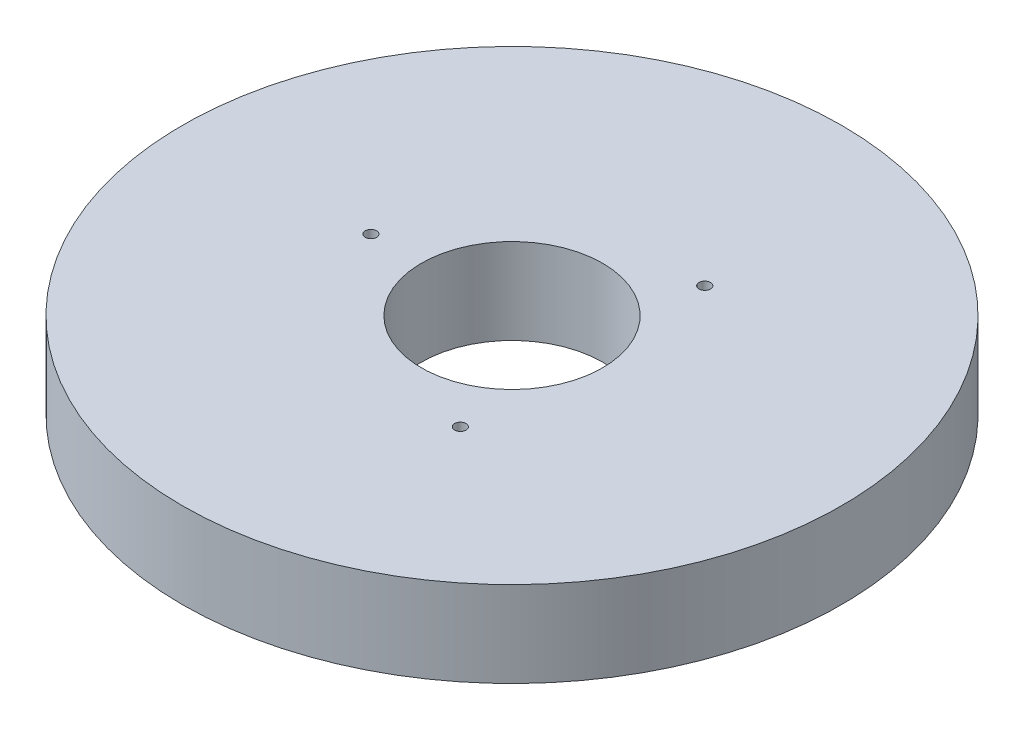
ISO-10303-21;
HEADER;
FILE_DESCRIPTION(('STEP AP214'),'2;1');
FILE_NAME('part.step','',(''),(''),'','','');
FILE_SCHEMA(('AUTOMOTIVE_DESIGN { 1 0 10303 214 1 1 1 1 }'));
ENDSEC;
DATA;
#1=APPLICATION_CONTEXT('core data for automotive mechanical design processes');
#2=APPLICATION_PROTOCOL_DEFINITION('international standard','automotive_design',2000,#1);
#3=PRODUCT_CONTEXT('',#1,'mechanical');
#4=PRODUCT('Part','Part','',(#3));
#5=PRODUCT_RELATED_PRODUCT_CATEGORY('part','',(#4));
#6=PRODUCT_DEFINITION_FORMATION('','',#4);
#7=PRODUCT_DEFINITION_CONTEXT('part definition',#1,'design');
#8=PRODUCT_DEFINITION('design','',#6,#7);
#9=PRODUCT_DEFINITION_SHAPE('','',#8);
#10=(LENGTH_UNIT() NAMED_UNIT(*) SI_UNIT(.MILLI.,.METRE.));
#11=(NAMED_UNIT(*) PLANE_ANGLE_UNIT() SI_UNIT($,.RADIAN.));
#12=(NAMED_UNIT(*) SI_UNIT($,.STERADIAN.) SOLID_ANGLE_UNIT());
#13=UNCERTAINTY_MEASURE_WITH_UNIT(LENGTH_MEASURE(1.E-05),#10,'distance_accuracy_value','');
#14=(GEOMETRIC_REPRESENTATION_CONTEXT(3) GLOBAL_UNCERTAINTY_ASSIGNED_CONTEXT((#13)) GLOBAL_UNIT_ASSIGNED_CONTEXT((#10,
#11,#12)) REPRESENTATION_CONTEXT('',''));
#15=CARTESIAN_POINT('',(0.,0.,0.));
#16=DIRECTION('',(0.,0.,1.));
#17=DIRECTION('',(1.,0.,0.));
#18=AXIS2_PLACEMENT_3D('',#15,#16,#17);
#19=CARTESIAN_POINT('',(0.,26.,0.));
#20=DIRECTION('',(0.,-1.,0.));
#21=DIRECTION('',(0.,0.,-1.));
#22=AXIS2_PLACEMENT_3D('',#19,#20,#21);
#23=CYLINDRICAL_SURFACE('',#22,100.);
#24=CARTESIAN_POINT('',(0.,26.,0.));
#25=DIRECTION('',(0.,1.,0.));
#26=DIRECTION('',(0.,0.,1.));
#27=AXIS2_PLACEMENT_3D('',#24,#25,#26);
#28=CIRCLE('',#27,100.);
#29=CARTESIAN_POINT('',(0.,26.,-100.));
#30=VERTEX_POINT('',#29);
#31=EDGE_CURVE('E10',#30,#30,#28,.T.);
#32=CARTESIAN_POINT('',(0.,0.,0.));
#33=DIRECTION('',(0.,1.,0.));
#34=DIRECTION('',(0.,0.,1.));
#35=AXIS2_PLACEMENT_3D('',#32,#33,#34);
#36=CIRCLE('',#35,100.);
#37=CARTESIAN_POINT('',(0.,0.,-100.));
#38=VERTEX_POINT('',#37);
#39=EDGE_CURVE('E37',#38,#38,#36,.T.);
#40=CARTESIAN_POINT('',(0.,26.,-100.));
#41=CARTESIAN_POINT('',(0.,25.7291666666667,-100.));
#42=CARTESIAN_POINT('',(0.,25.4583333333333,-100.));
#43=CARTESIAN_POINT('',(0.,24.9166666666667,-100.));
#44=CARTESIAN_POINT('',(0.,24.6458333333333,-100.));
#45=CARTESIAN_POINT('',(0.,24.1041666666667,-100.));
#46=CARTESIAN_POINT('',(0.,23.8333333333333,-100.));
#47=CARTESIAN_POINT('',(0.,23.2916666666667,-100.));
#48=CARTESIAN_POINT('',(0.,23.0208333333333,-100.));
#49=CARTESIAN_POINT('',(0.,22.4791666666667,-100.));
#50=CARTESIAN_POINT('',(0.,22.2083333333333,-100.));
#51=CARTESIAN_POINT('',(0.,21.6666666666667,-100.));
#52=CARTESIAN_POINT('',(0.,21.3958333333333,-100.));
#53=CARTESIAN_POINT('',(0.,20.8541666666667,-100.));
#54=CARTESIAN_POINT('',(0.,20.5833333333333,-100.));
#55=CARTESIAN_POINT('',(0.,20.0416666666667,-100.));
#56=CARTESIAN_POINT('',(0.,19.7708333333333,-100.));
#57=CARTESIAN_POINT('',(0.,19.2291666666667,-100.));
#58=CARTESIAN_POINT('',(0.,18.9583333333333,-100.));
#59=CARTESIAN_POINT('',(0.,18.4166666666667,-100.));
#60=CARTESIAN_POINT('',(0.,18.1458333333333,-100.));
#61=CARTESIAN_POINT('',(0.,17.6041666666667,-100.));
#62=CARTESIAN_POINT('',(0.,17.3333333333333,-100.));
#63=CARTESIAN_POINT('',(0.,16.7916666666667,-100.));
#64=CARTESIAN_POINT('',(0.,16.5208333333333,-100.));
#65=CARTESIAN_POINT('',(0.,15.9791666666667,-100.));
#66=CARTESIAN_POINT('',(0.,15.7083333333333,-100.));
#67=CARTESIAN_POINT('',(0.,15.1666666666667,-100.));
#68=CARTESIAN_POINT('',(0.,14.8958333333333,-100.));
#69=CARTESIAN_POINT('',(0.,14.3541666666667,-100.));
#70=CARTESIAN_POINT('',(0.,14.0833333333333,-100.));
#71=CARTESIAN_POINT('',(0.,13.5416666666667,-100.));
#72=CARTESIAN_POINT('',(0.,13.2708333333333,-100.));
#73=CARTESIAN_POINT('',(0.,12.7291666666667,-100.));
#74=CARTESIAN_POINT('',(0.,12.4583333333333,-100.));
#75=CARTESIAN_POINT('',(0.,11.9166666666667,-100.));
#76=CARTESIAN_POINT('',(0.,11.6458333333333,-100.));
#77=CARTESIAN_POINT('',(0.,11.1041666666667,-100.));
#78=CARTESIAN_POINT('',(0.,10.8333333333333,-100.));
#79=CARTESIAN_POINT('',(0.,10.2916666666667,-100.));
#80=CARTESIAN_POINT('',(0.,10.0208333333333,-100.));
#81=CARTESIAN_POINT('',(0.,9.47916666666667,-100.));
#82=CARTESIAN_POINT('',(0.,9.20833333333333,-100.));
#83=CARTESIAN_POINT('',(0.,8.66666666666667,-100.));
#84=CARTESIAN_POINT('',(0.,8.39583333333333,-100.));
#85=CARTESIAN_POINT('',(0.,7.85416666666667,-100.));
#86=CARTESIAN_POINT('',(0.,7.58333333333333,-100.));
#87=CARTESIAN_POINT('',(0.,7.04166666666667,-100.));
#88=CARTESIAN_POINT('',(0.,6.77083333333333,-100.));
#89=CARTESIAN_POINT('',(0.,6.22916666666667,-100.));
#90=CARTESIAN_POINT('',(0.,5.95833333333333,-100.));
#91=CARTESIAN_POINT('',(0.,5.41666666666667,-100.));
#92=CARTESIAN_POINT('',(0.,5.14583333333333,-100.));
#93=CARTESIAN_POINT('',(0.,4.60416666666667,-100.));
#94=CARTESIAN_POINT('',(0.,4.33333333333333,-100.));
#95=CARTESIAN_POINT('',(0.,3.79166666666667,-100.));
#96=CARTESIAN_POINT('',(0.,3.52083333333333,-100.));
#97=CARTESIAN_POINT('',(0.,2.97916666666667,-100.));
#98=CARTESIAN_POINT('',(0.,2.70833333333333,-100.));
#99=CARTESIAN_POINT('',(0.,2.16666666666667,-100.));
#100=CARTESIAN_POINT('',(0.,1.89583333333333,-100.));
#101=CARTESIAN_POINT('',(0.,1.35416666666667,-100.));
#102=CARTESIAN_POINT('',(0.,1.08333333333333,-100.));
#103=CARTESIAN_POINT('',(0.,0.541666666666667,-100.));
#104=CARTESIAN_POINT('',(0.,0.270833333333334,-100.));
#105=CARTESIAN_POINT('',(0.,0.,-100.));
#106=B_SPLINE_CURVE_WITH_KNOTS('',3,(#40,#41,#42,#43,#44,#45,#46,#47,#48,#49,#50,#51,#52,#53,
#54,#55,#56,#57,#58,#59,#60,#61,#62,#63,#64,#65,#66,#67,#68,#69,#70,#71,#72,#73,#74,#75,#76,#77,
#78,#79,#80,#81,#82,#83,#84,#85,#86,#87,#88,#89,#90,#91,#92,#93,#94,#95,#96,#97,#98,#99,#100,
#101,#102,#103,#104,#105),.UNSPECIFIED.,.F.,.F.,(4,2,2,2,2,2,2,2,2,2,2,2,2,2,2,2,2,2,2,2,2,2,2,
2,2,2,2,2,2,2,2,2,4),(0.,0.812500000000001,1.625,2.4375,3.25,4.0625,4.875,5.6875,6.5,7.3125,
8.125,8.9375,9.75,10.5625,11.375,12.1875,13.,13.8125,14.625,15.4375,16.25,17.0625,17.875,
18.6875,19.5,20.3125,21.125,21.9375,22.75,23.5625,24.375,25.1875,26.),.UNSPECIFIED.);
#107=EDGE_CURVE('BSEAM40',#30,#38,#106,.T.);
#108=ORIENTED_EDGE('',*,*,#31,.F.);
#109=ORIENTED_EDGE('',*,*,#39,.T.);
#110=ORIENTED_EDGE('',*,*,#107,.T.);
#111=ORIENTED_EDGE('',*,*,#107,.F.);
#112=EDGE_LOOP('',(#108,#110,#109,#111));
#113=FACE_BOUND('',#112,.T.);
#114=ADVANCED_FACE('F40',(#113),#23,.T.);
#115=CARTESIAN_POINT('',(0.,26.,0.));
#116=DIRECTION('',(0.,1.,0.));
#117=DIRECTION('',(0.,0.,1.));
#118=AXIS2_PLACEMENT_3D('',#115,#116,#117);
#119=PLANE('',#118);
#120=CARTESIAN_POINT('',(21.406078713894,26.,37.0764159232827));
#121=DIRECTION('',(0.,1.,0.));
#122=DIRECTION('',(0.866025403784436,0.,-0.500000000000004));
#123=AXIS2_PLACEMENT_3D('',#120,#121,#122);
#124=CIRCLE('',#123,1.7363609774763);
#125=CARTESIAN_POINT('',(22.9098114305285,26.,36.2082354345445));
#126=VERTEX_POINT('',#125);
#127=EDGE_CURVE('E70',#126,#126,#124,.T.);
#128=ORIENTED_EDGE('',*,*,#127,.F.);
#129=EDGE_LOOP('',(#128));
#130=FACE_BOUND('',#129,.T.);
#131=CARTESIAN_POINT('',(21.4060787138935,26.,-37.076415923283));
#132=DIRECTION('',(0.,1.,0.));
#133=DIRECTION('',(-0.866025403784443,0.,-0.499999999999992));
#134=AXIS2_PLACEMENT_3D('',#131,#132,#133);
#135=CIRCLE('',#134,1.7363609774763);
#136=CARTESIAN_POINT('',(19.902345997259,26.,-37.9445964120211));
#137=VERTEX_POINT('',#136);
#138=EDGE_CURVE('E61',#137,#137,#135,.T.);
#139=ORIENTED_EDGE('',*,*,#138,.F.);
#140=EDGE_LOOP('',(#139));
#141=FACE_BOUND('',#140,.T.);
#142=CARTESIAN_POINT('',(-42.8121574277877,26.,0.));
#143=DIRECTION('',(0.,1.,0.));
#144=DIRECTION('',(0.,0.,1.));
#145=AXIS2_PLACEMENT_3D('',#142,#143,#144);
#146=CIRCLE('',#145,1.7363609774763);
#147=CARTESIAN_POINT('',(-42.8121574277877,26.,1.7363609774763));
#148=VERTEX_POINT('',#147);
#149=EDGE_CURVE('E54',#148,#148,#146,.T.);
#150=ORIENTED_EDGE('',*,*,#149,.F.);
#151=EDGE_LOOP('',(#150));
#152=FACE_BOUND('',#151,.T.);
#153=CARTESIAN_POINT('',(0.,26.,0.));
#154=DIRECTION('',(0.,1.,0.));
#155=DIRECTION('',(0.,0.,1.));
#156=AXIS2_PLACEMENT_3D('',#153,#154,#155);
#157=CIRCLE('',#156,27.5);
#158=CARTESIAN_POINT('',(0.,26.,-27.5));
#159=VERTEX_POINT('',#158);
#160=EDGE_CURVE('E50',#159,#159,#157,.T.);
#161=ORIENTED_EDGE('',*,*,#160,.F.);
#162=EDGE_LOOP('',(#161));
#163=FACE_BOUND('',#162,.T.);
#164=ORIENTED_EDGE('',*,*,#31,.T.);
#165=EDGE_LOOP('',(#164));
#166=FACE_BOUND('',#165,.T.);
#167=ADVANCED_FACE('F85',(#130,#141,#152,#163,#166),#119,.T.);
#168=CARTESIAN_POINT('',(0.,0.,0.));
#169=DIRECTION('',(0.,1.,0.));
#170=DIRECTION('',(0.,0.,1.));
#171=AXIS2_PLACEMENT_3D('',#168,#169,#170);
#172=PLANE('',#171);
#173=CARTESIAN_POINT('',(0.,0.,0.));
#174=DIRECTION('',(0.,1.,0.));
#175=DIRECTION('',(0.,0.,1.));
#176=AXIS2_PLACEMENT_3D('',#173,#174,#175);
#177=CIRCLE('',#176,27.5);
#178=CARTESIAN_POINT('',(0.,0.,-27.5));
#179=VERTEX_POINT('',#178);
#180=EDGE_CURVE('E47',#179,#179,#177,.T.);
#181=ORIENTED_EDGE('',*,*,#180,.T.);
#182=EDGE_LOOP('',(#181));
#183=FACE_BOUND('',#182,.T.);
#184=ORIENTED_EDGE('',*,*,#39,.F.);
#185=EDGE_LOOP('',(#184));
#186=FACE_BOUND('',#185,.T.);
#187=ADVANCED_FACE('F84',(#183,#186),#172,.F.);
#188=CARTESIAN_POINT('',(0.,26.,0.));
#189=DIRECTION('',(0.,-1.,0.));
#190=DIRECTION('',(0.,0.,-1.));
#191=AXIS2_PLACEMENT_3D('',#188,#189,#190);
#192=CYLINDRICAL_SURFACE('',#191,27.5);
#193=CARTESIAN_POINT('',(0.,26.,-27.5));
#194=CARTESIAN_POINT('',(0.,25.7291666666667,-27.5));
#195=CARTESIAN_POINT('',(0.,25.4583333333333,-27.5));
#196=CARTESIAN_POINT('',(0.,24.9166666666667,-27.5));
#197=CARTESIAN_POINT('',(0.,24.6458333333333,-27.5));
#198=CARTESIAN_POINT('',(0.,24.1041666666667,-27.5));
#199=CARTESIAN_POINT('',(0.,23.8333333333333,-27.5));
#200=CARTESIAN_POINT('',(0.,23.2916666666667,-27.5));
#201=CARTESIAN_POINT('',(0.,23.0208333333333,-27.5));
#202=CARTESIAN_POINT('',(0.,22.4791666666667,-27.5));
#203=CARTESIAN_POINT('',(0.,22.2083333333333,-27.5));
#204=CARTESIAN_POINT('',(0.,21.6666666666667,-27.5));
#205=CARTESIAN_POINT('',(0.,21.3958333333333,-27.5));
#206=CARTESIAN_POINT('',(0.,20.8541666666667,-27.5));
#207=CARTESIAN_POINT('',(0.,20.5833333333333,-27.5));
#208=CARTESIAN_POINT('',(0.,20.0416666666667,-27.5));
#209=CARTESIAN_POINT('',(0.,19.7708333333333,-27.5));
#210=CARTESIAN_POINT('',(0.,19.2291666666667,-27.5));
#211=CARTESIAN_POINT('',(0.,18.9583333333333,-27.5));
#212=CARTESIAN_POINT('',(0.,18.4166666666667,-27.5));
#213=CARTESIAN_POINT('',(0.,18.1458333333333,-27.5));
#214=CARTESIAN_POINT('',(0.,17.6041666666667,-27.5));
#215=CARTESIAN_POINT('',(0.,17.3333333333333,-27.5));
#216=CARTESIAN_POINT('',(0.,16.7916666666667,-27.5));
#217=CARTESIAN_POINT('',(0.,16.5208333333333,-27.5));
#218=CARTESIAN_POINT('',(0.,15.9791666666667,-27.5));
#219=CARTESIAN_POINT('',(0.,15.7083333333333,-27.5));
#220=CARTESIAN_POINT('',(0.,15.1666666666667,-27.5));
#221=CARTESIAN_POINT('',(0.,14.8958333333333,-27.5));
#222=CARTESIAN_POINT('',(0.,14.3541666666667,-27.5));
#223=CARTESIAN_POINT('',(0.,14.0833333333333,-27.5));
#224=CARTESIAN_POINT('',(0.,13.5416666666667,-27.5));
#225=CARTESIAN_POINT('',(0.,13.2708333333333,-27.5));
#226=CARTESIAN_POINT('',(0.,12.7291666666667,-27.5));
#227=CARTESIAN_POINT('',(0.,12.4583333333333,-27.5));
#228=CARTESIAN_POINT('',(0.,11.9166666666667,-27.5));
#229=CARTESIAN_POINT('',(0.,11.6458333333333,-27.5));
#230=CARTESIAN_POINT('',(0.,11.1041666666667,-27.5));
#231=CARTESIAN_POINT('',(0.,10.8333333333333,-27.5));
#232=CARTESIAN_POINT('',(0.,10.2916666666667,-27.5));
#233=CARTESIAN_POINT('',(0.,10.0208333333333,-27.5));
#234=CARTESIAN_POINT('',(0.,9.47916666666667,-27.5));
#235=CARTESIAN_POINT('',(0.,9.20833333333333,-27.5));
#236=CARTESIAN_POINT('',(0.,8.66666666666667,-27.5));
#237=CARTESIAN_POINT('',(0.,8.39583333333333,-27.5));
#238=CARTESIAN_POINT('',(0.,7.85416666666667,-27.5));
#239=CARTESIAN_POINT('',(0.,7.58333333333333,-27.5));
#240=CARTESIAN_POINT('',(0.,7.04166666666667,-27.5));
#241=CARTESIAN_POINT('',(0.,6.77083333333333,-27.5));
#242=CARTESIAN_POINT('',(0.,6.22916666666667,-27.5));
#243=CARTESIAN_POINT('',(0.,5.95833333333333,-27.5));
#244=CARTESIAN_POINT('',(0.,5.41666666666667,-27.5));
#245=CARTESIAN_POINT('',(0.,5.14583333333333,-27.5));
#246=CARTESIAN_POINT('',(0.,4.60416666666667,-27.5));
#247=CARTESIAN_POINT('',(0.,4.33333333333333,-27.5));
#248=CARTESIAN_POINT('',(0.,3.79166666666667,-27.5));
#249=CARTESIAN_POINT('',(0.,3.52083333333333,-27.5));
#250=CARTESIAN_POINT('',(0.,2.97916666666667,-27.5));
#251=CARTESIAN_POINT('',(0.,2.70833333333333,-27.5));
#252=CARTESIAN_POINT('',(0.,2.16666666666667,-27.5));
#253=CARTESIAN_POINT('',(0.,1.89583333333333,-27.5));
#254=CARTESIAN_POINT('',(0.,1.35416666666667,-27.5));
#255=CARTESIAN_POINT('',(0.,1.08333333333333,-27.5));
#256=CARTESIAN_POINT('',(0.,0.541666666666667,-27.5));
#257=CARTESIAN_POINT('',(0.,0.270833333333334,-27.5));
#258=CARTESIAN_POINT('',(0.,0.,-27.5));
#259=B_SPLINE_CURVE_WITH_KNOTS('',3,(#193,#194,#195,#196,#197,#198,#199,#200,#201,#202,#203,
#204,#205,#206,#207,#208,#209,#210,#211,#212,#213,#214,#215,#216,#217,#218,#219,#220,#221,#222,
#223,#224,#225,#226,#227,#228,#229,#230,#231,#232,#233,#234,#235,#236,#237,#238,#239,#240,#241,
#242,#243,#244,#245,#246,#247,#248,#249,#250,#251,#252,#253,#254,#255,#256,#257,#258),
.UNSPECIFIED.,.F.,.F.,(4,2,2,2,2,2,2,2,2,2,2,2,2,2,2,2,2,2,2,2,2,2,2,2,2,2,2,2,2,2,2,2,4),(0.,
0.812500000000001,1.625,2.4375,3.25,4.0625,4.875,5.6875,6.5,7.3125,8.125,8.9375,9.75,10.5625,
11.375,12.1875,13.,13.8125,14.625,15.4375,16.25,17.0625,17.875,18.6875,19.5,20.3125,21.125,
21.9375,22.75,23.5625,24.375,25.1875,26.),.UNSPECIFIED.);
#260=EDGE_CURVE('BSEAM91',#159,#179,#259,.T.);
#261=ORIENTED_EDGE('',*,*,#160,.T.);
#262=ORIENTED_EDGE('',*,*,#180,.F.);
#263=ORIENTED_EDGE('',*,*,#260,.T.);
#264=ORIENTED_EDGE('',*,*,#260,.F.);
#265=EDGE_LOOP('',(#261,#263,#262,#264));
#266=FACE_BOUND('',#265,.T.);
#267=ADVANCED_FACE('F91',(#266),#192,.F.);
#268=CARTESIAN_POINT('',(-42.8121574277877,3.13083693107759,0.));
#269=DIRECTION('',(0.,1.,0.));
#270=DIRECTION('',(0.,0.,1.));
#271=AXIS2_PLACEMENT_3D('',#268,#269,#270);
#272=CYLINDRICAL_SURFACE('',#271,1.7363609774763);
#273=CARTESIAN_POINT('',(-42.8121574277877,3.13083693107759,0.));
#274=DIRECTION('',(0.,1.,0.));
#275=DIRECTION('',(0.,0.,1.));
#276=AXIS2_PLACEMENT_3D('',#273,#274,#275);
#277=CIRCLE('',#276,1.7363609774763);
#278=CARTESIAN_POINT('',(-42.8121574277877,3.13083693107759,1.7363609774763));
#279=VERTEX_POINT('',#278);
#280=EDGE_CURVE('E55',#279,#279,#277,.T.);
#281=ORIENTED_EDGE('',*,*,#280,.F.);
#282=EDGE_LOOP('',(#281));
#283=FACE_BOUND('',#282,.T.);
#284=ORIENTED_EDGE('',*,*,#149,.T.);
#285=EDGE_LOOP('',(#284));
#286=FACE_BOUND('',#285,.T.);
#287=ADVANCED_FACE('F96',(#283,#286),#272,.F.);
#288=CARTESIAN_POINT('',(-42.8121574277877,3.13083693107759,0.));
#289=DIRECTION('',(0.,1.,0.));
#290=DIRECTION('',(0.,0.,1.));
#291=AXIS2_PLACEMENT_3D('',#288,#289,#290);
#292=PLANE('',#291);
#293=ORIENTED_EDGE('',*,*,#280,.T.);
#294=EDGE_LOOP('',(#293));
#295=FACE_BOUND('',#294,.T.);
#296=ADVANCED_FACE('F127',(#295),#292,.T.);
#297=CARTESIAN_POINT('',(21.4060787138935,3.13083693107759,-37.076415923283));
#298=DIRECTION('',(0.,1.,0.));
#299=DIRECTION('',(0.,0.,1.));
#300=AXIS2_PLACEMENT_3D('',#297,#298,#299);
#301=CYLINDRICAL_SURFACE('',#300,1.7363609774763);
#302=CARTESIAN_POINT('',(21.4060787138935,3.13083693107759,-37.076415923283));
#303=DIRECTION('',(0.,1.,0.));
#304=DIRECTION('',(-0.866025403784443,0.,-0.499999999999992));
#305=AXIS2_PLACEMENT_3D('',#302,#303,#304);
#306=CIRCLE('',#305,1.7363609774763);
#307=CARTESIAN_POINT('',(19.902345997259,3.13083693107759,-37.9445964120211));
#308=VERTEX_POINT('',#307);
#309=EDGE_CURVE('E63',#308,#308,#306,.T.);
#310=ORIENTED_EDGE('',*,*,#309,.F.);
#311=EDGE_LOOP('',(#310));
#312=FACE_BOUND('',#311,.T.);
#313=ORIENTED_EDGE('',*,*,#138,.T.);
#314=EDGE_LOOP('',(#313));
#315=FACE_BOUND('',#314,.T.);
#316=ADVANCED_FACE('F133',(#312,#315),#301,.F.);
#317=CARTESIAN_POINT('',(21.4060787138935,3.13083693107759,-37.076415923283));
#318=DIRECTION('',(0.,1.,0.));
#319=DIRECTION('',(-0.866025403784443,0.,-0.499999999999992));
#320=AXIS2_PLACEMENT_3D('',#317,#318,#319);
#321=PLANE('',#320);
#322=ORIENTED_EDGE('',*,*,#309,.T.);
#323=EDGE_LOOP('',(#322));
#324=FACE_BOUND('',#323,.T.);
#325=ADVANCED_FACE('F77',(#324),#321,.T.);
#326=CARTESIAN_POINT('',(21.406078713894,3.13083693107759,37.0764159232827));
#327=DIRECTION('',(0.,1.,0.));
#328=DIRECTION('',(0.,0.,1.));
#329=AXIS2_PLACEMENT_3D('',#326,#327,#328);
#330=CYLINDRICAL_SURFACE('',#329,1.7363609774763);
#331=CARTESIAN_POINT('',(21.406078713894,3.13083693107759,37.0764159232827));
#332=DIRECTION('',(0.,1.,0.));
#333=DIRECTION('',(0.866025403784436,0.,-0.500000000000004));
#334=AXIS2_PLACEMENT_3D('',#331,#332,#333);
#335=CIRCLE('',#334,1.7363609774763);
#336=CARTESIAN_POINT('',(22.9098114305285,3.13083693107759,36.2082354345445));
#337=VERTEX_POINT('',#336);
#338=EDGE_CURVE('E59',#337,#337,#335,.T.);
#339=ORIENTED_EDGE('',*,*,#338,.F.);
#340=EDGE_LOOP('',(#339));
#341=FACE_BOUND('',#340,.T.);
#342=ORIENTED_EDGE('',*,*,#127,.T.);
#343=EDGE_LOOP('',(#342));
#344=FACE_BOUND('',#343,.T.);
#345=ADVANCED_FACE('F73',(#341,#344),#330,.F.);
#346=CARTESIAN_POINT('',(21.406078713894,3.13083693107759,37.0764159232827));
#347=DIRECTION('',(0.,1.,0.));
#348=DIRECTION('',(0.866025403784436,0.,-0.500000000000004));
#349=AXIS2_PLACEMENT_3D('',#346,#347,#348);
#350=PLANE('',#349);
#351=ORIENTED_EDGE('',*,*,#338,.T.);
#352=EDGE_LOOP('',(#351));
#353=FACE_BOUND('',#352,.T.);
#354=ADVANCED_FACE('F71',(#353),#350,.T.);
#355=CLOSED_SHELL('',(#114,#167,#187,#267,#287,#296,#316,#325,#345,#354));
#356=MANIFOLD_SOLID_BREP('B2',#355);
#357=ADVANCED_BREP_SHAPE_REPRESENTATION('',(#18,#356),#14);
#358=SHAPE_DEFINITION_REPRESENTATION(#9,#357);
ENDSEC;
END-ISO-10303-21;
